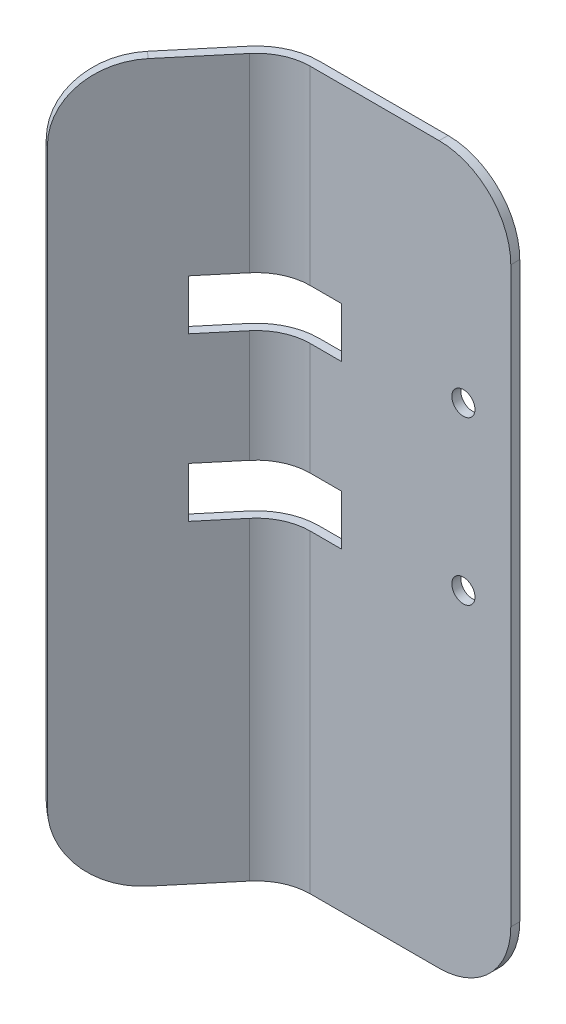
ISO-10303-21;
HEADER;
FILE_DESCRIPTION(('STEP AP214'),'2;1');
FILE_NAME('part.step','',(''),(''),'','','');
FILE_SCHEMA(('AUTOMOTIVE_DESIGN { 1 0 10303 214 1 1 1 1 }'));
ENDSEC;
DATA;
#1=APPLICATION_CONTEXT('core data for automotive mechanical design processes');
#2=APPLICATION_PROTOCOL_DEFINITION('international standard','automotive_design',2000,#1);
#3=PRODUCT_CONTEXT('',#1,'mechanical');
#4=PRODUCT('Part','Part','',(#3));
#5=PRODUCT_RELATED_PRODUCT_CATEGORY('part','',(#4));
#6=PRODUCT_DEFINITION_FORMATION('','',#4);
#7=PRODUCT_DEFINITION_CONTEXT('part definition',#1,'design');
#8=PRODUCT_DEFINITION('design','',#6,#7);
#9=PRODUCT_DEFINITION_SHAPE('','',#8);
#10=(LENGTH_UNIT() NAMED_UNIT(*) SI_UNIT(.MILLI.,.METRE.));
#11=(NAMED_UNIT(*) PLANE_ANGLE_UNIT() SI_UNIT($,.RADIAN.));
#12=(NAMED_UNIT(*) SI_UNIT($,.STERADIAN.) SOLID_ANGLE_UNIT());
#13=UNCERTAINTY_MEASURE_WITH_UNIT(LENGTH_MEASURE(1.E-05),#10,'distance_accuracy_value','');
#14=(GEOMETRIC_REPRESENTATION_CONTEXT(3) GLOBAL_UNCERTAINTY_ASSIGNED_CONTEXT((#13)) GLOBAL_UNIT_ASSIGNED_CONTEXT((#10,
#11,#12)) REPRESENTATION_CONTEXT('',''));
#15=CARTESIAN_POINT('',(0.,0.,0.));
#16=DIRECTION('',(0.,0.,1.));
#17=DIRECTION('',(1.,0.,0.));
#18=AXIS2_PLACEMENT_3D('',#15,#16,#17);
#19=CARTESIAN_POINT('',(-35.56,127.,9.52500000000001));
#20=DIRECTION('',(0.,-1.,0.));
#21=DIRECTION('',(0.,0.,-1.));
#22=AXIS2_PLACEMENT_3D('',#19,#20,#21);
#23=CYLINDRICAL_SURFACE('',#22,11.1125);
#24=DIRECTION('',(0.,-1.,0.));
#25=VECTOR('',#24,1.);
#26=CARTESIAN_POINT('',(-44.0726688741597,127.,2.38202268735836));
#27=LINE('',#26,#25);
#28=CARTESIAN_POINT('',(-44.0726688741597,84.455,2.38202268735836));
#29=VERTEX_POINT('',#28);
#30=CARTESIAN_POINT('',(-44.0726688741597,64.561067728,2.38202268735836));
#31=VERTEX_POINT('',#30);
#32=EDGE_CURVE('E387',#29,#31,#27,.T.);
#33=ORIENTED_EDGE('',*,*,#32,.F.);
#34=CARTESIAN_POINT('',(-35.56,84.455,9.52500000000001));
#35=DIRECTION('',(0.,-1.,0.));
#36=DIRECTION('',(0.,0.,-1.));
#37=AXIS2_PLACEMENT_3D('',#34,#35,#36);
#38=CIRCLE('',#37,11.1125);
#39=CARTESIAN_POINT('',(-35.56,84.455,-1.5875));
#40=VERTEX_POINT('',#39);
#41=EDGE_CURVE('E307',#29,#40,#38,.T.);
#42=ORIENTED_EDGE('',*,*,#41,.T.);
#43=DIRECTION('',(0.,-1.,0.));
#44=VECTOR('',#43,1.);
#45=CARTESIAN_POINT('',(-35.56,127.,-1.5875));
#46=LINE('',#45,#44);
#47=CARTESIAN_POINT('',(-35.56,64.561067728,-1.5875));
#48=VERTEX_POINT('',#47);
#49=EDGE_CURVE('E393',#40,#48,#46,.T.);
#50=ORIENTED_EDGE('',*,*,#49,.T.);
#51=CARTESIAN_POINT('',(-35.56,64.561067728,9.52500000000001));
#52=DIRECTION('',(0.,1.,0.));
#53=DIRECTION('',(-1.,0.,0.));
#54=AXIS2_PLACEMENT_3D('',#51,#52,#53);
#55=CIRCLE('',#54,11.1125);
#56=EDGE_CURVE('E256',#48,#31,#55,.T.);
#57=ORIENTED_EDGE('',*,*,#56,.T.);
#58=EDGE_LOOP('',(#33,#42,#50,#57));
#59=FACE_BOUND('',#58,.T.);
#60=ADVANCED_FACE('F37',(#59),#23,.T.);
#61=CARTESIAN_POINT('',(-44.0726688741597,55.671067728,2.38202268735836));
#62=VERTEX_POINT('',#61);
#63=CARTESIAN_POINT('',(-44.0726688741597,0.,2.38202268735836));
#64=VERTEX_POINT('',#63);
#65=EDGE_CURVE('E381',#62,#64,#27,.T.);
#66=ORIENTED_EDGE('',*,*,#65,.F.);
#67=CARTESIAN_POINT('',(-35.56,55.671067728,9.52500000000001));
#68=DIRECTION('',(0.,-1.,0.));
#69=DIRECTION('',(0.,0.,-1.));
#70=AXIS2_PLACEMENT_3D('',#67,#68,#69);
#71=CIRCLE('',#70,11.1125);
#72=CARTESIAN_POINT('',(-35.56,55.671067728,-1.5875));
#73=VERTEX_POINT('',#72);
#74=EDGE_CURVE('E276',#62,#73,#71,.T.);
#75=ORIENTED_EDGE('',*,*,#74,.T.);
#76=CARTESIAN_POINT('',(-35.56,0.,-1.5875));
#77=VERTEX_POINT('',#76);
#78=EDGE_CURVE('E386',#73,#77,#46,.T.);
#79=ORIENTED_EDGE('',*,*,#78,.T.);
#80=CARTESIAN_POINT('',(-35.56,0.,9.52500000000001));
#81=DIRECTION('',(0.,1.,0.));
#82=DIRECTION('',(0.,0.,1.));
#83=AXIS2_PLACEMENT_3D('',#80,#81,#82);
#84=CIRCLE('',#83,11.1125);
#85=EDGE_CURVE('E343',#77,#64,#84,.T.);
#86=ORIENTED_EDGE('',*,*,#85,.T.);
#87=EDGE_LOOP('',(#66,#75,#79,#86));
#88=FACE_BOUND('',#87,.T.);
#89=ADVANCED_FACE('F563',(#88),#23,.T.);
#90=CARTESIAN_POINT('',(-35.56,127.,9.52500000000001));
#91=DIRECTION('',(0.,-1.,0.));
#92=DIRECTION('',(0.,0.,-1.));
#93=AXIS2_PLACEMENT_3D('',#90,#91,#92);
#94=CYLINDRICAL_SURFACE('',#93,9.525);
#95=DIRECTION('',(0.,-1.,0.));
#96=VECTOR('',#95,1.);
#97=CARTESIAN_POINT('',(-35.56,127.,0.));
#98=LINE('',#97,#96);
#99=CARTESIAN_POINT('',(-35.56,84.455,0.));
#100=VERTEX_POINT('',#99);
#101=CARTESIAN_POINT('',(-35.56,64.561067728,0.));
#102=VERTEX_POINT('',#101);
#103=EDGE_CURVE('E367',#100,#102,#98,.T.);
#104=ORIENTED_EDGE('',*,*,#103,.F.);
#105=CARTESIAN_POINT('',(-35.56,84.455,9.52500000000001));
#106=DIRECTION('',(0.,-1.,0.));
#107=DIRECTION('',(0.,0.,-1.));
#108=AXIS2_PLACEMENT_3D('',#105,#106,#107);
#109=CIRCLE('',#108,9.525);
#110=CARTESIAN_POINT('',(-42.8565733207083,84.455,3.40244801773573));
#111=VERTEX_POINT('',#110);
#112=EDGE_CURVE('E295',#100,#111,#109,.F.);
#113=ORIENTED_EDGE('',*,*,#112,.T.);
#114=DIRECTION('',(0.,-1.,0.));
#115=VECTOR('',#114,1.);
#116=CARTESIAN_POINT('',(-42.8565733207083,127.,3.40244801773573));
#117=LINE('',#116,#115);
#118=CARTESIAN_POINT('',(-42.8565733207083,64.561067728,3.40244801773573));
#119=VERTEX_POINT('',#118);
#120=EDGE_CURVE('E373',#111,#119,#117,.T.);
#121=ORIENTED_EDGE('',*,*,#120,.T.);
#122=CARTESIAN_POINT('',(-35.56,64.561067728,9.52500000000001));
#123=DIRECTION('',(0.,1.,0.));
#124=DIRECTION('',(-1.,0.,0.));
#125=AXIS2_PLACEMENT_3D('',#122,#123,#124);
#126=CIRCLE('',#125,9.525);
#127=EDGE_CURVE('E248',#119,#102,#126,.F.);
#128=ORIENTED_EDGE('',*,*,#127,.T.);
#129=EDGE_LOOP('',(#104,#113,#121,#128));
#130=FACE_BOUND('',#129,.T.);
#131=ADVANCED_FACE('F575',(#130),#94,.F.);
#132=CARTESIAN_POINT('',(-35.56,55.671067728,0.));
#133=VERTEX_POINT('',#132);
#134=CARTESIAN_POINT('',(-35.56,0.,0.));
#135=VERTEX_POINT('',#134);
#136=EDGE_CURVE('E361',#133,#135,#98,.T.);
#137=ORIENTED_EDGE('',*,*,#136,.F.);
#138=CARTESIAN_POINT('',(-35.56,55.671067728,9.52500000000001));
#139=DIRECTION('',(0.,-1.,0.));
#140=DIRECTION('',(0.,0.,-1.));
#141=AXIS2_PLACEMENT_3D('',#138,#139,#140);
#142=CIRCLE('',#141,9.525);
#143=CARTESIAN_POINT('',(-42.8565733207083,55.671067728,3.40244801773573));
#144=VERTEX_POINT('',#143);
#145=EDGE_CURVE('E266',#133,#144,#142,.F.);
#146=ORIENTED_EDGE('',*,*,#145,.T.);
#147=CARTESIAN_POINT('',(-42.8565733207083,0.,3.40244801773573));
#148=VERTEX_POINT('',#147);
#149=EDGE_CURVE('E366',#144,#148,#117,.T.);
#150=ORIENTED_EDGE('',*,*,#149,.T.);
#151=CARTESIAN_POINT('',(-35.56,0.,9.52500000000001));
#152=DIRECTION('',(0.,-1.,0.));
#153=DIRECTION('',(0.,0.,1.));
#154=AXIS2_PLACEMENT_3D('',#151,#152,#153);
#155=CIRCLE('',#154,9.525);
#156=EDGE_CURVE('E353',#148,#135,#155,.T.);
#157=ORIENTED_EDGE('',*,*,#156,.T.);
#158=EDGE_LOOP('',(#137,#146,#150,#157));
#159=FACE_BOUND('',#158,.T.);
#160=ADVANCED_FACE('F583',(#159),#94,.F.);
#161=CARTESIAN_POINT('',(0.,127.,-1.5875));
#162=DIRECTION('',(-1.,0.,0.));
#163=DIRECTION('',(0.,0.,1.));
#164=AXIS2_PLACEMENT_3D('',#161,#162,#163);
#165=PLANE('',#164);
#166=DIRECTION('',(0.,-1.,0.));
#167=VECTOR('',#166,1.);
#168=CARTESIAN_POINT('',(0.,127.,-1.5875));
#169=LINE('',#168,#167);
#170=CARTESIAN_POINT('',(0.,114.3,-1.5875));
#171=VERTEX_POINT('',#170);
#172=CARTESIAN_POINT('',(0.,12.7,-1.5875));
#173=VERTEX_POINT('',#172);
#174=EDGE_CURVE('E392',#171,#173,#169,.T.);
#175=ORIENTED_EDGE('',*,*,#174,.F.);
#176=DIRECTION('',(0.,0.,-1.));
#177=VECTOR('',#176,1.);
#178=CARTESIAN_POINT('',(0.,114.3,0.));
#179=LINE('',#178,#177);
#180=CARTESIAN_POINT('',(0.,114.3,0.));
#181=VERTEX_POINT('',#180);
#182=EDGE_CURVE('E59',#171,#181,#179,.F.);
#183=ORIENTED_EDGE('',*,*,#182,.T.);
#184=DIRECTION('',(0.,-1.,0.));
#185=VECTOR('',#184,1.);
#186=CARTESIAN_POINT('',(0.,127.,0.));
#187=LINE('',#186,#185);
#188=CARTESIAN_POINT('',(0.,12.7,0.));
#189=VERTEX_POINT('',#188);
#190=EDGE_CURVE('E340',#181,#189,#187,.T.);
#191=ORIENTED_EDGE('',*,*,#190,.T.);
#192=DIRECTION('',(0.,0.,-1.));
#193=VECTOR('',#192,1.);
#194=CARTESIAN_POINT('',(0.,12.7,-1.5875));
#195=LINE('',#194,#193);
#196=EDGE_CURVE('E466',#189,#173,#195,.T.);
#197=ORIENTED_EDGE('',*,*,#196,.T.);
#198=EDGE_LOOP('',(#175,#183,#191,#197));
#199=FACE_BOUND('',#198,.T.);
#200=ADVANCED_FACE('F534',(#199),#165,.F.);
#201=CARTESIAN_POINT('',(0.,127.,-1.5875));
#202=DIRECTION('',(0.,0.,1.));
#203=DIRECTION('',(1.,0.,0.));
#204=AXIS2_PLACEMENT_3D('',#201,#202,#203);
#205=PLANE('',#204);
#206=CARTESIAN_POINT('',(-8.399999964,60.116067728,-1.5875));
#207=DIRECTION('',(0.,0.,-1.));
#208=DIRECTION('',(-1.,0.,0.));
#209=AXIS2_PLACEMENT_3D('',#206,#207,#208);
#210=CIRCLE('',#209,2.049999964);
#211=CARTESIAN_POINT('',(-10.449999928,60.116067728,-1.5875));
#212=VERTEX_POINT('',#211);
#213=EDGE_CURVE('E479',#212,#212,#210,.T.);
#214=ORIENTED_EDGE('',*,*,#213,.F.);
#215=EDGE_LOOP('',(#214));
#216=FACE_BOUND('',#215,.T.);
#217=CARTESIAN_POINT('',(-8.39999996399993,88.9,-1.5875));
#218=DIRECTION('',(0.,0.,-1.));
#219=DIRECTION('',(-1.,0.,0.));
#220=AXIS2_PLACEMENT_3D('',#217,#218,#219);
#221=CIRCLE('',#220,2.049999964);
#222=CARTESIAN_POINT('',(-10.4499999279999,88.9,-1.5875));
#223=VERTEX_POINT('',#222);
#224=EDGE_CURVE('E401',#223,#223,#221,.T.);
#225=ORIENTED_EDGE('',*,*,#224,.F.);
#226=EDGE_LOOP('',(#225));
#227=FACE_BOUND('',#226,.T.);
#228=DIRECTION('',(-1.,0.,0.));
#229=VECTOR('',#228,1.);
#230=CARTESIAN_POINT('',(0.,127.,-1.5875));
#231=LINE('',#230,#229);
#232=CARTESIAN_POINT('',(-12.7,127.,-1.5875));
#233=VERTEX_POINT('',#232);
#234=CARTESIAN_POINT('',(-35.56,127.,-1.5875));
#235=VERTEX_POINT('',#234);
#236=EDGE_CURVE('E319',#233,#235,#231,.T.);
#237=ORIENTED_EDGE('',*,*,#236,.F.);
#238=CARTESIAN_POINT('',(-12.7,114.3,-1.5875));
#239=DIRECTION('',(0.,0.,1.));
#240=DIRECTION('',(1.,0.,0.));
#241=AXIS2_PLACEMENT_3D('',#238,#239,#240);
#242=CIRCLE('',#241,12.7);
#243=EDGE_CURVE('E463',#233,#171,#242,.F.);
#244=ORIENTED_EDGE('',*,*,#243,.T.);
#245=ORIENTED_EDGE('',*,*,#174,.T.);
#246=CARTESIAN_POINT('',(-12.7,12.7,-1.5875));
#247=DIRECTION('',(0.,0.,1.));
#248=DIRECTION('',(1.,0.,0.));
#249=AXIS2_PLACEMENT_3D('',#246,#247,#248);
#250=CIRCLE('',#249,12.7);
#251=CARTESIAN_POINT('',(-12.7,0.,-1.5875));
#252=VERTEX_POINT('',#251);
#253=EDGE_CURVE('E460',#173,#252,#250,.F.);
#254=ORIENTED_EDGE('',*,*,#253,.T.);
#255=DIRECTION('',(-1.,0.,0.));
#256=VECTOR('',#255,1.);
#257=CARTESIAN_POINT('',(0.,0.,-1.5875));
#258=LINE('',#257,#256);
#259=EDGE_CURVE('E318',#252,#77,#258,.T.);
#260=ORIENTED_EDGE('',*,*,#259,.T.);
#261=ORIENTED_EDGE('',*,*,#78,.F.);
#262=DIRECTION('',(-1.,0.,0.));
#263=VECTOR('',#262,1.);
#264=CARTESIAN_POINT('',(-29.989999964,55.671067728,-1.5875));
#265=LINE('',#264,#263);
#266=CARTESIAN_POINT('',(-29.989999964,55.671067728,-1.5875));
#267=VERTEX_POINT('',#266);
#268=EDGE_CURVE('E499',#267,#73,#265,.T.);
#269=ORIENTED_EDGE('',*,*,#268,.F.);
#270=DIRECTION('',(0.,-1.,0.));
#271=VECTOR('',#270,1.);
#272=CARTESIAN_POINT('',(-29.989999964,55.671067728,-1.5875));
#273=LINE('',#272,#271);
#274=CARTESIAN_POINT('',(-29.989999964,64.561067728,-1.5875));
#275=VERTEX_POINT('',#274);
#276=EDGE_CURVE('E497',#275,#267,#273,.T.);
#277=ORIENTED_EDGE('',*,*,#276,.F.);
#278=DIRECTION('',(1.,0.,0.));
#279=VECTOR('',#278,1.);
#280=CARTESIAN_POINT('',(-29.989999964,64.561067728,-1.5875));
#281=LINE('',#280,#279);
#282=EDGE_CURVE('E486',#48,#275,#281,.T.);
#283=ORIENTED_EDGE('',*,*,#282,.F.);
#284=ORIENTED_EDGE('',*,*,#49,.F.);
#285=DIRECTION('',(-1.,0.,0.));
#286=VECTOR('',#285,1.);
#287=CARTESIAN_POINT('',(-29.9899999639999,84.455,-1.5875));
#288=LINE('',#287,#286);
#289=CARTESIAN_POINT('',(-29.9899999639999,84.455,-1.5875));
#290=VERTEX_POINT('',#289);
#291=EDGE_CURVE('E476',#290,#40,#288,.T.);
#292=ORIENTED_EDGE('',*,*,#291,.F.);
#293=DIRECTION('',(0.,-1.,0.));
#294=VECTOR('',#293,1.);
#295=CARTESIAN_POINT('',(-29.9899999639999,84.455,-1.5875));
#296=LINE('',#295,#294);
#297=CARTESIAN_POINT('',(-29.9899999639999,93.345,-1.5875));
#298=VERTEX_POINT('',#297);
#299=EDGE_CURVE('E490',#298,#290,#296,.T.);
#300=ORIENTED_EDGE('',*,*,#299,.F.);
#301=DIRECTION('',(1.,0.,0.));
#302=VECTOR('',#301,1.);
#303=CARTESIAN_POINT('',(-29.9899999639999,93.345,-1.5875));
#304=LINE('',#303,#302);
#305=CARTESIAN_POINT('',(-35.56,93.345,-1.5875));
#306=VERTEX_POINT('',#305);
#307=EDGE_CURVE('E492',#306,#298,#304,.T.);
#308=ORIENTED_EDGE('',*,*,#307,.F.);
#309=EDGE_CURVE('E388',#235,#306,#46,.T.);
#310=ORIENTED_EDGE('',*,*,#309,.F.);
#311=EDGE_LOOP('',(#237,#244,#245,#254,#260,#261,#269,#277,#283,#284,#292,#300,#308,#310));
#312=FACE_BOUND('',#311,.T.);
#313=ADVANCED_FACE('F530',(#216,#227,#312),#205,.F.);
#314=ORIENTED_EDGE('',*,*,#309,.T.);
#315=CARTESIAN_POINT('',(-35.56,93.345,9.52500000000001));
#316=DIRECTION('',(0.,1.,0.));
#317=DIRECTION('',(0.,0.,1.));
#318=AXIS2_PLACEMENT_3D('',#315,#316,#317);
#319=CIRCLE('',#318,11.1125);
#320=CARTESIAN_POINT('',(-44.0726688741597,93.345,2.38202268735836));
#321=VERTEX_POINT('',#320);
#322=EDGE_CURVE('E291',#306,#321,#319,.T.);
#323=ORIENTED_EDGE('',*,*,#322,.T.);
#324=CARTESIAN_POINT('',(-44.0726688741597,127.,2.38202268735836));
#325=VERTEX_POINT('',#324);
#326=EDGE_CURVE('E382',#325,#321,#27,.T.);
#327=ORIENTED_EDGE('',*,*,#326,.F.);
#328=CARTESIAN_POINT('',(-35.56,127.,9.52500000000001));
#329=DIRECTION('',(0.,1.,0.));
#330=DIRECTION('',(0.,0.,1.));
#331=AXIS2_PLACEMENT_3D('',#328,#329,#330);
#332=CIRCLE('',#331,11.1125);
#333=EDGE_CURVE('E322',#235,#325,#332,.T.);
#334=ORIENTED_EDGE('',*,*,#333,.F.);
#335=EDGE_LOOP('',(#314,#323,#327,#334));
#336=FACE_BOUND('',#335,.T.);
#337=ADVANCED_FACE('F533',(#336),#23,.T.);
#338=CARTESIAN_POINT('',(-44.0726688741597,127.,2.38202268735836));
#339=DIRECTION('',(0.76604444311898,0.,0.642787609686537));
#340=DIRECTION('',(0.642787609686537,0.,-0.76604444311898));
#341=AXIS2_PLACEMENT_3D('',#338,#339,#340);
#342=PLANE('',#341);
#343=DIRECTION('',(0.,-1.,0.));
#344=VECTOR('',#343,1.);
#345=CARTESIAN_POINT('',(-60.4330574842094,127.,21.8795745896226));
#346=LINE('',#345,#344);
#347=CARTESIAN_POINT('',(-60.4330574842094,114.3,21.8795745896226));
#348=VERTEX_POINT('',#347);
#349=CARTESIAN_POINT('',(-60.4330574842094,12.7,21.8795745896226));
#350=VERTEX_POINT('',#349);
#351=EDGE_CURVE('E377',#348,#350,#346,.T.);
#352=ORIENTED_EDGE('',*,*,#351,.F.);
#353=CARTESIAN_POINT('',(-52.2696548411904,114.3,12.1508101620116));
#354=DIRECTION('',(0.76604444311898,0.,0.642787609686537));
#355=DIRECTION('',(0.642787609686537,0.,-0.76604444311898));
#356=AXIS2_PLACEMENT_3D('',#353,#354,#355);
#357=CIRCLE('',#356,12.7);
#358=CARTESIAN_POINT('',(-52.2696548411904,127.,12.1508101620116));
#359=VERTEX_POINT('',#358);
#360=EDGE_CURVE('E451',#348,#359,#357,.F.);
#361=ORIENTED_EDGE('',*,*,#360,.T.);
#362=DIRECTION('',(-0.642787609686537,0.,0.76604444311898));
#363=VECTOR('',#362,1.);
#364=CARTESIAN_POINT('',(-44.0726688741597,127.,2.38202268735836));
#365=LINE('',#364,#363);
#366=EDGE_CURVE('E326',#325,#359,#365,.T.);
#367=ORIENTED_EDGE('',*,*,#366,.F.);
#368=ORIENTED_EDGE('',*,*,#326,.T.);
#369=DIRECTION('',(-0.642787609686537,0.,0.76604444311898));
#370=VECTOR('',#369,1.);
#371=CARTESIAN_POINT('',(-44.0726688741597,93.345,2.38202268735836));
#372=LINE('',#371,#370);
#373=CARTESIAN_POINT('',(-49.0399999639999,93.345,8.30185735928045));
#374=VERTEX_POINT('',#373);
#375=EDGE_CURVE('E287',#321,#374,#372,.T.);
#376=ORIENTED_EDGE('',*,*,#375,.T.);
#377=DIRECTION('',(0.,-1.,0.));
#378=VECTOR('',#377,1.);
#379=CARTESIAN_POINT('',(-49.0399999639999,127.,8.30185735928045));
#380=LINE('',#379,#378);
#381=CARTESIAN_POINT('',(-49.0399999639999,84.455,8.30185735928045));
#382=VERTEX_POINT('',#381);
#383=EDGE_CURVE('E314',#374,#382,#380,.T.);
#384=ORIENTED_EDGE('',*,*,#383,.T.);
#385=DIRECTION('',(0.642787609686537,0.,-0.76604444311898));
#386=VECTOR('',#385,1.);
#387=CARTESIAN_POINT('',(-44.0726688741597,84.455,2.38202268735836));
#388=LINE('',#387,#386);
#389=EDGE_CURVE('E303',#382,#29,#388,.T.);
#390=ORIENTED_EDGE('',*,*,#389,.T.);
#391=ORIENTED_EDGE('',*,*,#32,.T.);
#392=DIRECTION('',(-0.642787609686537,0.,0.76604444311898));
#393=VECTOR('',#392,1.);
#394=CARTESIAN_POINT('',(-44.0726688741597,64.561067728,2.38202268735838));
#395=LINE('',#394,#393);
#396=CARTESIAN_POINT('',(-49.039999964,64.561067728,8.30185735928054));
#397=VERTEX_POINT('',#396);
#398=EDGE_CURVE('E251',#31,#397,#395,.T.);
#399=ORIENTED_EDGE('',*,*,#398,.T.);
#400=DIRECTION('',(0.,-1.,0.));
#401=VECTOR('',#400,1.);
#402=CARTESIAN_POINT('',(-49.039999964,127.,8.30185735928055));
#403=LINE('',#402,#401);
#404=CARTESIAN_POINT('',(-49.0399999639999,55.671067728,8.30185735928061));
#405=VERTEX_POINT('',#404);
#406=EDGE_CURVE('E228',#397,#405,#403,.T.);
#407=ORIENTED_EDGE('',*,*,#406,.T.);
#408=DIRECTION('',(0.642787609686537,0.,-0.76604444311898));
#409=VECTOR('',#408,1.);
#410=CARTESIAN_POINT('',(-44.0726688741597,55.671067728,2.38202268735836));
#411=LINE('',#410,#409);
#412=EDGE_CURVE('E272',#405,#62,#411,.T.);
#413=ORIENTED_EDGE('',*,*,#412,.T.);
#414=ORIENTED_EDGE('',*,*,#65,.T.);
#415=DIRECTION('',(-0.642787609686537,0.,0.76604444311898));
#416=VECTOR('',#415,1.);
#417=CARTESIAN_POINT('',(-44.0726688741597,0.,2.38202268735836));
#418=LINE('',#417,#416);
#419=CARTESIAN_POINT('',(-52.2696548411904,0.,12.1508101620116));
#420=VERTEX_POINT('',#419);
#421=EDGE_CURVE('E347',#64,#420,#418,.T.);
#422=ORIENTED_EDGE('',*,*,#421,.T.);
#423=CARTESIAN_POINT('',(-52.2696548411904,12.7,12.1508101620116));
#424=DIRECTION('',(0.76604444311898,0.,0.642787609686537));
#425=DIRECTION('',(0.642787609686537,0.,-0.76604444311898));
#426=AXIS2_PLACEMENT_3D('',#423,#424,#425);
#427=CIRCLE('',#426,12.7);
#428=EDGE_CURVE('E448',#420,#350,#427,.F.);
#429=ORIENTED_EDGE('',*,*,#428,.T.);
#430=EDGE_LOOP('',(#352,#361,#367,#368,#376,#384,#390,#391,#399,#407,#413,#414,#422,#429));
#431=FACE_BOUND('',#430,.T.);
#432=ADVANCED_FACE('F591',(#431),#342,.F.);
#433=CARTESIAN_POINT('',(-60.4330574842094,127.,21.8795745896226));
#434=DIRECTION('',(0.642787609686537,0.,-0.76604444311898));
#435=DIRECTION('',(-0.76604444311898,0.,-0.642787609686537));
#436=AXIS2_PLACEMENT_3D('',#433,#434,#435);
#437=PLANE('',#436);
#438=DIRECTION('',(0.,-1.,0.));
#439=VECTOR('',#438,1.);
#440=CARTESIAN_POINT('',(-59.216961930758,127.,22.89999992));
#441=LINE('',#440,#439);
#442=CARTESIAN_POINT('',(-59.216961930758,114.3,22.89999992));
#443=VERTEX_POINT('',#442);
#444=CARTESIAN_POINT('',(-59.216961930758,12.7,22.89999992));
#445=VERTEX_POINT('',#444);
#446=EDGE_CURVE('E372',#443,#445,#441,.T.);
#447=ORIENTED_EDGE('',*,*,#446,.F.);
#448=DIRECTION('',(0.76604444311898,0.,0.642787609686537));
#449=VECTOR('',#448,1.);
#450=CARTESIAN_POINT('',(-60.4330574842094,114.3,21.8795745896226));
#451=LINE('',#450,#449);
#452=EDGE_CURVE('E445',#443,#348,#451,.F.);
#453=ORIENTED_EDGE('',*,*,#452,.T.);
#454=ORIENTED_EDGE('',*,*,#351,.T.);
#455=DIRECTION('',(0.76604444311898,0.,0.642787609686537));
#456=VECTOR('',#455,1.);
#457=CARTESIAN_POINT('',(-60.4330574842094,12.7,21.8795745896226));
#458=LINE('',#457,#456);
#459=EDGE_CURVE('E442',#350,#445,#458,.T.);
#460=ORIENTED_EDGE('',*,*,#459,.T.);
#461=EDGE_LOOP('',(#447,#453,#454,#460));
#462=FACE_BOUND('',#461,.T.);
#463=ADVANCED_FACE('F595',(#462),#437,.F.);
#464=CARTESIAN_POINT('',(-42.8565733207083,127.,3.40244801773574));
#465=DIRECTION('',(-0.76604444311898,0.,-0.642787609686537));
#466=DIRECTION('',(-0.642787609686537,0.,0.76604444311898));
#467=AXIS2_PLACEMENT_3D('',#464,#465,#466);
#468=PLANE('',#467);
#469=DIRECTION('',(-0.642787609686537,0.,0.76604444311898));
#470=VECTOR('',#469,1.);
#471=CARTESIAN_POINT('',(-42.8565733207083,55.671067728,3.40244801773574));
#472=LINE('',#471,#470);
#473=CARTESIAN_POINT('',(-47.8239044105486,55.671067728,9.32228268965792));
#474=VERTEX_POINT('',#473);
#475=EDGE_CURVE('E243',#144,#474,#472,.T.);
#476=ORIENTED_EDGE('',*,*,#475,.T.);
#477=DIRECTION('',(0.,1.,0.));
#478=VECTOR('',#477,1.);
#479=CARTESIAN_POINT('',(-47.8239044105486,64.561067728,9.32228268965792));
#480=LINE('',#479,#478);
#481=CARTESIAN_POINT('',(-47.8239044105486,64.561067728,9.32228268965792));
#482=VERTEX_POINT('',#481);
#483=EDGE_CURVE('E225',#474,#482,#480,.T.);
#484=ORIENTED_EDGE('',*,*,#483,.T.);
#485=DIRECTION('',(0.642787609686537,0.,-0.76604444311898));
#486=VECTOR('',#485,1.);
#487=CARTESIAN_POINT('',(-42.8565733207083,64.561067728,3.40244801773576));
#488=LINE('',#487,#486);
#489=EDGE_CURVE('E240',#482,#119,#488,.T.);
#490=ORIENTED_EDGE('',*,*,#489,.T.);
#491=ORIENTED_EDGE('',*,*,#120,.F.);
#492=DIRECTION('',(-0.642787609686537,0.,0.76604444311898));
#493=VECTOR('',#492,1.);
#494=CARTESIAN_POINT('',(-42.8565733207083,84.455,3.40244801773574));
#495=LINE('',#494,#493);
#496=CARTESIAN_POINT('',(-47.8239044105486,84.455,9.32228268965783));
#497=VERTEX_POINT('',#496);
#498=EDGE_CURVE('E299',#111,#497,#495,.T.);
#499=ORIENTED_EDGE('',*,*,#498,.T.);
#500=DIRECTION('',(0.,1.,0.));
#501=VECTOR('',#500,1.);
#502=CARTESIAN_POINT('',(-47.8239044105486,93.345,9.32228268965783));
#503=LINE('',#502,#501);
#504=CARTESIAN_POINT('',(-47.8239044105486,93.345,9.32228268965783));
#505=VERTEX_POINT('',#504);
#506=EDGE_CURVE('E233',#497,#505,#503,.T.);
#507=ORIENTED_EDGE('',*,*,#506,.T.);
#508=DIRECTION('',(0.642787609686537,0.,-0.76604444311898));
#509=VECTOR('',#508,1.);
#510=CARTESIAN_POINT('',(-42.8565733207083,93.345,3.40244801773574));
#511=LINE('',#510,#509);
#512=CARTESIAN_POINT('',(-42.8565733207083,93.345,3.40244801773573));
#513=VERTEX_POINT('',#512);
#514=EDGE_CURVE('E284',#505,#513,#511,.T.);
#515=ORIENTED_EDGE('',*,*,#514,.T.);
#516=CARTESIAN_POINT('',(-42.8565733207083,127.,3.40244801773573));
#517=VERTEX_POINT('',#516);
#518=EDGE_CURVE('E368',#517,#513,#117,.T.);
#519=ORIENTED_EDGE('',*,*,#518,.F.);
#520=DIRECTION('',(0.642787609686537,0.,-0.76604444311898));
#521=VECTOR('',#520,1.);
#522=CARTESIAN_POINT('',(-42.8565733207083,127.,3.40244801773574));
#523=LINE('',#522,#521);
#524=CARTESIAN_POINT('',(-51.053559287739,127.,13.171235492389));
#525=VERTEX_POINT('',#524);
#526=EDGE_CURVE('E330',#525,#517,#523,.T.);
#527=ORIENTED_EDGE('',*,*,#526,.F.);
#528=CARTESIAN_POINT('',(-51.053559287739,114.3,13.171235492389));
#529=DIRECTION('',(-0.76604444311898,0.,-0.642787609686537));
#530=DIRECTION('',(-0.642787609686537,0.,0.76604444311898));
#531=AXIS2_PLACEMENT_3D('',#528,#529,#530);
#532=CIRCLE('',#531,12.7);
#533=EDGE_CURVE('E439',#525,#443,#532,.F.);
#534=ORIENTED_EDGE('',*,*,#533,.T.);
#535=ORIENTED_EDGE('',*,*,#446,.T.);
#536=CARTESIAN_POINT('',(-51.053559287739,12.7,13.171235492389));
#537=DIRECTION('',(-0.76604444311898,0.,-0.642787609686537));
#538=DIRECTION('',(-0.642787609686537,0.,0.76604444311898));
#539=AXIS2_PLACEMENT_3D('',#536,#537,#538);
#540=CIRCLE('',#539,12.7);
#541=CARTESIAN_POINT('',(-51.053559287739,0.,13.171235492389));
#542=VERTEX_POINT('',#541);
#543=EDGE_CURVE('E436',#445,#542,#540,.F.);
#544=ORIENTED_EDGE('',*,*,#543,.T.);
#545=DIRECTION('',(0.642787609686537,0.,-0.76604444311898));
#546=VECTOR('',#545,1.);
#547=CARTESIAN_POINT('',(-42.8565733207083,0.,3.40244801773574));
#548=LINE('',#547,#546);
#549=EDGE_CURVE('E351',#542,#148,#548,.T.);
#550=ORIENTED_EDGE('',*,*,#549,.T.);
#551=ORIENTED_EDGE('',*,*,#149,.F.);
#552=EDGE_LOOP('',(#476,#484,#490,#491,#499,#507,#515,#519,#527,#534,#535,#544,#550,#551));
#553=FACE_BOUND('',#552,.T.);
#554=ADVANCED_FACE('F238',(#553),#468,.F.);
#555=ORIENTED_EDGE('',*,*,#518,.T.);
#556=CARTESIAN_POINT('',(-35.56,93.345,9.52500000000001));
#557=DIRECTION('',(0.,1.,0.));
#558=DIRECTION('',(0.,0.,1.));
#559=AXIS2_PLACEMENT_3D('',#556,#557,#558);
#560=CIRCLE('',#559,9.525);
#561=CARTESIAN_POINT('',(-35.56,93.345,0.));
#562=VERTEX_POINT('',#561);
#563=EDGE_CURVE('E280',#513,#562,#560,.F.);
#564=ORIENTED_EDGE('',*,*,#563,.T.);
#565=CARTESIAN_POINT('',(-35.56,127.,0.));
#566=VERTEX_POINT('',#565);
#567=EDGE_CURVE('E362',#566,#562,#98,.T.);
#568=ORIENTED_EDGE('',*,*,#567,.F.);
#569=CARTESIAN_POINT('',(-35.56,127.,9.52500000000001));
#570=DIRECTION('',(0.,-1.,0.));
#571=DIRECTION('',(0.,0.,1.));
#572=AXIS2_PLACEMENT_3D('',#569,#570,#571);
#573=CIRCLE('',#572,9.525);
#574=EDGE_CURVE('E333',#517,#566,#573,.T.);
#575=ORIENTED_EDGE('',*,*,#574,.F.);
#576=EDGE_LOOP('',(#555,#564,#568,#575));
#577=FACE_BOUND('',#576,.T.);
#578=ADVANCED_FACE('F609',(#577),#94,.F.);
#579=CARTESIAN_POINT('',(0.,127.,0.));
#580=DIRECTION('',(0.,0.,-1.));
#581=DIRECTION('',(-1.,0.,0.));
#582=AXIS2_PLACEMENT_3D('',#579,#580,#581);
#583=PLANE('',#582);
#584=CARTESIAN_POINT('',(-8.399999964,60.116067728,0.));
#585=DIRECTION('',(0.,0.,-1.));
#586=DIRECTION('',(-1.,0.,0.));
#587=AXIS2_PLACEMENT_3D('',#584,#585,#586);
#588=CIRCLE('',#587,2.049999964);
#589=CARTESIAN_POINT('',(-10.449999928,60.116067728,0.));
#590=VERTEX_POINT('',#589);
#591=EDGE_CURVE('E311',#590,#590,#588,.T.);
#592=ORIENTED_EDGE('',*,*,#591,.T.);
#593=EDGE_LOOP('',(#592));
#594=FACE_BOUND('',#593,.T.);
#595=CARTESIAN_POINT('',(-8.39999996399993,88.9,0.));
#596=DIRECTION('',(0.,0.,-1.));
#597=DIRECTION('',(-1.,0.,0.));
#598=AXIS2_PLACEMENT_3D('',#595,#596,#597);
#599=CIRCLE('',#598,2.049999964);
#600=CARTESIAN_POINT('',(-10.4499999279999,88.9,0.));
#601=VERTEX_POINT('',#600);
#602=EDGE_CURVE('E259',#601,#601,#599,.T.);
#603=ORIENTED_EDGE('',*,*,#602,.T.);
#604=EDGE_LOOP('',(#603));
#605=FACE_BOUND('',#604,.T.);
#606=ORIENTED_EDGE('',*,*,#190,.F.);
#607=CARTESIAN_POINT('',(-12.7,114.3,0.));
#608=DIRECTION('',(0.,0.,-1.));
#609=DIRECTION('',(-1.,0.,0.));
#610=AXIS2_PLACEMENT_3D('',#607,#608,#609);
#611=CIRCLE('',#610,12.7);
#612=CARTESIAN_POINT('',(-12.7,127.,0.));
#613=VERTEX_POINT('',#612);
#614=EDGE_CURVE('E11',#181,#613,#611,.F.);
#615=ORIENTED_EDGE('',*,*,#614,.T.);
#616=DIRECTION('',(1.,0.,0.));
#617=VECTOR('',#616,1.);
#618=CARTESIAN_POINT('',(0.,127.,0.));
#619=LINE('',#618,#617);
#620=EDGE_CURVE('E336',#566,#613,#619,.T.);
#621=ORIENTED_EDGE('',*,*,#620,.F.);
#622=ORIENTED_EDGE('',*,*,#567,.T.);
#623=DIRECTION('',(1.,0.,0.));
#624=VECTOR('',#623,1.);
#625=CARTESIAN_POINT('',(0.,93.345,0.));
#626=LINE('',#625,#624);
#627=CARTESIAN_POINT('',(-29.9899999639999,93.345,0.));
#628=VERTEX_POINT('',#627);
#629=EDGE_CURVE('E413',#562,#628,#626,.T.);
#630=ORIENTED_EDGE('',*,*,#629,.T.);
#631=DIRECTION('',(0.,-1.,0.));
#632=VECTOR('',#631,1.);
#633=CARTESIAN_POINT('',(-29.9899999639999,127.,0.));
#634=LINE('',#633,#632);
#635=CARTESIAN_POINT('',(-29.9899999639999,84.455,0.));
#636=VERTEX_POINT('',#635);
#637=EDGE_CURVE('E417',#628,#636,#634,.T.);
#638=ORIENTED_EDGE('',*,*,#637,.T.);
#639=DIRECTION('',(-1.,0.,0.));
#640=VECTOR('',#639,1.);
#641=CARTESIAN_POINT('',(0.,84.455,0.));
#642=LINE('',#641,#640);
#643=EDGE_CURVE('E421',#636,#100,#642,.T.);
#644=ORIENTED_EDGE('',*,*,#643,.T.);
#645=ORIENTED_EDGE('',*,*,#103,.T.);
#646=DIRECTION('',(1.,0.,0.));
#647=VECTOR('',#646,1.);
#648=CARTESIAN_POINT('',(0.,64.561067728,0.));
#649=LINE('',#648,#647);
#650=CARTESIAN_POINT('',(-29.989999964,64.561067728,0.));
#651=VERTEX_POINT('',#650);
#652=EDGE_CURVE('E397',#102,#651,#649,.T.);
#653=ORIENTED_EDGE('',*,*,#652,.T.);
#654=DIRECTION('',(0.,-1.,0.));
#655=VECTOR('',#654,1.);
#656=CARTESIAN_POINT('',(-29.989999964,127.,0.));
#657=LINE('',#656,#655);
#658=CARTESIAN_POINT('',(-29.989999964,55.671067728,0.));
#659=VERTEX_POINT('',#658);
#660=EDGE_CURVE('E405',#651,#659,#657,.T.);
#661=ORIENTED_EDGE('',*,*,#660,.T.);
#662=DIRECTION('',(-1.,0.,0.));
#663=VECTOR('',#662,1.);
#664=CARTESIAN_POINT('',(0.,55.671067728,0.));
#665=LINE('',#664,#663);
#666=EDGE_CURVE('E409',#659,#133,#665,.T.);
#667=ORIENTED_EDGE('',*,*,#666,.T.);
#668=ORIENTED_EDGE('',*,*,#136,.T.);
#669=DIRECTION('',(1.,0.,0.));
#670=VECTOR('',#669,1.);
#671=CARTESIAN_POINT('',(0.,0.,0.));
#672=LINE('',#671,#670);
#673=CARTESIAN_POINT('',(-12.7,0.,0.));
#674=VERTEX_POINT('',#673);
#675=EDGE_CURVE('E323',#135,#674,#672,.T.);
#676=ORIENTED_EDGE('',*,*,#675,.T.);
#677=CARTESIAN_POINT('',(-12.7,12.7,0.));
#678=DIRECTION('',(0.,0.,-1.));
#679=DIRECTION('',(-1.,0.,0.));
#680=AXIS2_PLACEMENT_3D('',#677,#678,#679);
#681=CIRCLE('',#680,12.7);
#682=EDGE_CURVE('E46',#674,#189,#681,.F.);
#683=ORIENTED_EDGE('',*,*,#682,.T.);
#684=EDGE_LOOP('',(#606,#615,#621,#622,#630,#638,#644,#645,#653,#661,#667,#668,#676,#683));
#685=FACE_BOUND('',#684,.T.);
#686=ADVANCED_FACE('F549',(#594,#605,#685),#583,.F.);
#687=CARTESIAN_POINT('',(-35.56,127.,9.52500000000001));
#688=DIRECTION('',(0.,1.,0.));
#689=DIRECTION('',(0.,0.,1.));
#690=AXIS2_PLACEMENT_3D('',#687,#688,#689);
#691=PLANE('',#690);
#692=ORIENTED_EDGE('',*,*,#366,.T.);
#693=DIRECTION('',(0.76604444311898,0.,0.642787609686537));
#694=VECTOR('',#693,1.);
#695=CARTESIAN_POINT('',(-51.053559287739,127.,13.171235492389));
#696=LINE('',#695,#694);
#697=EDGE_CURVE('E432',#359,#525,#696,.T.);
#698=ORIENTED_EDGE('',*,*,#697,.T.);
#699=ORIENTED_EDGE('',*,*,#526,.T.);
#700=ORIENTED_EDGE('',*,*,#574,.T.);
#701=ORIENTED_EDGE('',*,*,#620,.T.);
#702=DIRECTION('',(0.,0.,-1.));
#703=VECTOR('',#702,1.);
#704=CARTESIAN_POINT('',(-12.7,127.,-1.5875));
#705=LINE('',#704,#703);
#706=EDGE_CURVE('E425',#613,#233,#705,.T.);
#707=ORIENTED_EDGE('',*,*,#706,.T.);
#708=ORIENTED_EDGE('',*,*,#236,.T.);
#709=ORIENTED_EDGE('',*,*,#333,.T.);
#710=EDGE_LOOP('',(#692,#698,#699,#700,#701,#707,#708,#709));
#711=FACE_BOUND('',#710,.T.);
#712=ADVANCED_FACE('F542',(#711),#691,.T.);
#713=CARTESIAN_POINT('',(-35.56,0.,9.52500000000001));
#714=DIRECTION('',(0.,1.,0.));
#715=DIRECTION('',(0.,0.,1.));
#716=AXIS2_PLACEMENT_3D('',#713,#714,#715);
#717=PLANE('',#716);
#718=ORIENTED_EDGE('',*,*,#549,.F.);
#719=DIRECTION('',(0.76604444311898,0.,0.642787609686537));
#720=VECTOR('',#719,1.);
#721=CARTESIAN_POINT('',(-43.7569859670307,0.,19.2937874746532));
#722=LINE('',#721,#720);
#723=EDGE_CURVE('E457',#542,#420,#722,.F.);
#724=ORIENTED_EDGE('',*,*,#723,.T.);
#725=ORIENTED_EDGE('',*,*,#421,.F.);
#726=ORIENTED_EDGE('',*,*,#85,.F.);
#727=ORIENTED_EDGE('',*,*,#259,.F.);
#728=DIRECTION('',(0.,0.,-1.));
#729=VECTOR('',#728,1.);
#730=CARTESIAN_POINT('',(-12.7,0.,9.52500000000001));
#731=LINE('',#730,#729);
#732=EDGE_CURVE('E454',#252,#674,#731,.F.);
#733=ORIENTED_EDGE('',*,*,#732,.T.);
#734=ORIENTED_EDGE('',*,*,#675,.F.);
#735=ORIENTED_EDGE('',*,*,#156,.F.);
#736=EDGE_LOOP('',(#718,#724,#725,#726,#727,#733,#734,#735));
#737=FACE_BOUND('',#736,.T.);
#738=ADVANCED_FACE('F558',(#737),#717,.F.);
#739=CARTESIAN_POINT('',(-8.39999996399993,88.9,22.89999992));
#740=DIRECTION('',(0.,0.,-1.));
#741=DIRECTION('',(-1.,0.,0.));
#742=AXIS2_PLACEMENT_3D('',#739,#740,#741);
#743=CYLINDRICAL_SURFACE('',#742,2.049999964);
#744=ORIENTED_EDGE('',*,*,#224,.T.);
#745=EDGE_LOOP('',(#744));
#746=FACE_BOUND('',#745,.T.);
#747=ORIENTED_EDGE('',*,*,#602,.F.);
#748=EDGE_LOOP('',(#747));
#749=FACE_BOUND('',#748,.T.);
#750=ADVANCED_FACE('F527',(#746,#749),#743,.F.);
#751=CARTESIAN_POINT('',(-29.989999964,55.671067728,22.89999992));
#752=DIRECTION('',(0.,-1.,0.));
#753=DIRECTION('',(0.,0.,-1.));
#754=AXIS2_PLACEMENT_3D('',#751,#752,#753);
#755=PLANE('',#754);
#756=ORIENTED_EDGE('',*,*,#412,.F.);
#757=DIRECTION('',(0.76604444311898,0.,0.642787609686537));
#758=VECTOR('',#757,1.);
#759=CARTESIAN_POINT('',(-56.4578139268794,55.671067728,2.07757239888679));
#760=LINE('',#759,#758);
#761=EDGE_CURVE('E234',#405,#474,#760,.T.);
#762=ORIENTED_EDGE('',*,*,#761,.T.);
#763=ORIENTED_EDGE('',*,*,#475,.F.);
#764=ORIENTED_EDGE('',*,*,#145,.F.);
#765=ORIENTED_EDGE('',*,*,#666,.F.);
#766=DIRECTION('',(0.,0.,-1.));
#767=VECTOR('',#766,1.);
#768=CARTESIAN_POINT('',(-29.989999964,55.671067728,22.89999992));
#769=LINE('',#768,#767);
#770=EDGE_CURVE('E511',#659,#267,#769,.T.);
#771=ORIENTED_EDGE('',*,*,#770,.T.);
#772=ORIENTED_EDGE('',*,*,#268,.T.);
#773=ORIENTED_EDGE('',*,*,#74,.F.);
#774=EDGE_LOOP('',(#756,#762,#763,#764,#765,#771,#772,#773));
#775=FACE_BOUND('',#774,.T.);
#776=ADVANCED_FACE('F567',(#775),#755,.F.);
#777=CARTESIAN_POINT('',(-29.989999964,55.671067728,22.89999992));
#778=DIRECTION('',(1.,0.,0.));
#779=DIRECTION('',(0.,0.,-1.));
#780=AXIS2_PLACEMENT_3D('',#777,#778,#779);
#781=PLANE('',#780);
#782=DIRECTION('',(0.,0.,-1.));
#783=VECTOR('',#782,1.);
#784=CARTESIAN_POINT('',(-29.989999964,64.561067728,22.89999992));
#785=LINE('',#784,#783);
#786=EDGE_CURVE('E510',#651,#275,#785,.T.);
#787=ORIENTED_EDGE('',*,*,#786,.T.);
#788=ORIENTED_EDGE('',*,*,#276,.T.);
#789=ORIENTED_EDGE('',*,*,#770,.F.);
#790=ORIENTED_EDGE('',*,*,#660,.F.);
#791=EDGE_LOOP('',(#787,#788,#789,#790));
#792=FACE_BOUND('',#791,.T.);
#793=ADVANCED_FACE('F571',(#792),#781,.F.);
#794=CARTESIAN_POINT('',(-29.989999964,64.561067728,22.89999992));
#795=DIRECTION('',(0.,1.,0.));
#796=DIRECTION('',(-1.,0.,0.));
#797=AXIS2_PLACEMENT_3D('',#794,#795,#796);
#798=PLANE('',#797);
#799=ORIENTED_EDGE('',*,*,#489,.F.);
#800=DIRECTION('',(0.76604444311898,0.,0.642787609686537));
#801=VECTOR('',#800,1.);
#802=CARTESIAN_POINT('',(-56.4578139268794,64.561067728,2.07757239888679));
#803=LINE('',#802,#801);
#804=EDGE_CURVE('E222',#397,#482,#803,.T.);
#805=ORIENTED_EDGE('',*,*,#804,.F.);
#806=ORIENTED_EDGE('',*,*,#398,.F.);
#807=ORIENTED_EDGE('',*,*,#56,.F.);
#808=ORIENTED_EDGE('',*,*,#282,.T.);
#809=ORIENTED_EDGE('',*,*,#786,.F.);
#810=ORIENTED_EDGE('',*,*,#652,.F.);
#811=ORIENTED_EDGE('',*,*,#127,.F.);
#812=EDGE_LOOP('',(#799,#805,#806,#807,#808,#809,#810,#811));
#813=FACE_BOUND('',#812,.T.);
#814=ADVANCED_FACE('F246',(#813),#798,.F.);
#815=CARTESIAN_POINT('',(-29.9899999639999,84.455,22.89999992));
#816=DIRECTION('',(0.,-1.,0.));
#817=DIRECTION('',(0.,0.,-1.));
#818=AXIS2_PLACEMENT_3D('',#815,#816,#817);
#819=PLANE('',#818);
#820=ORIENTED_EDGE('',*,*,#389,.F.);
#821=DIRECTION('',(0.76604444311898,0.,0.642787609686537));
#822=VECTOR('',#821,1.);
#823=CARTESIAN_POINT('',(-56.4578139268793,84.455,2.0775723988867));
#824=LINE('',#823,#822);
#825=EDGE_CURVE('E487',#382,#497,#824,.T.);
#826=ORIENTED_EDGE('',*,*,#825,.T.);
#827=ORIENTED_EDGE('',*,*,#498,.F.);
#828=ORIENTED_EDGE('',*,*,#112,.F.);
#829=ORIENTED_EDGE('',*,*,#643,.F.);
#830=DIRECTION('',(0.,0.,-1.));
#831=VECTOR('',#830,1.);
#832=CARTESIAN_POINT('',(-29.9899999639999,84.455,22.89999992));
#833=LINE('',#832,#831);
#834=EDGE_CURVE('E475',#636,#290,#833,.T.);
#835=ORIENTED_EDGE('',*,*,#834,.T.);
#836=ORIENTED_EDGE('',*,*,#291,.T.);
#837=ORIENTED_EDGE('',*,*,#41,.F.);
#838=EDGE_LOOP('',(#820,#826,#827,#828,#829,#835,#836,#837));
#839=FACE_BOUND('',#838,.T.);
#840=ADVANCED_FACE('F620',(#839),#819,.F.);
#841=CARTESIAN_POINT('',(-29.9899999639999,84.455,22.89999992));
#842=DIRECTION('',(1.,0.,0.));
#843=DIRECTION('',(0.,0.,-1.));
#844=AXIS2_PLACEMENT_3D('',#841,#842,#843);
#845=PLANE('',#844);
#846=DIRECTION('',(0.,0.,-1.));
#847=VECTOR('',#846,1.);
#848=CARTESIAN_POINT('',(-29.9899999639999,93.345,22.89999992));
#849=LINE('',#848,#847);
#850=EDGE_CURVE('E474',#628,#298,#849,.T.);
#851=ORIENTED_EDGE('',*,*,#850,.T.);
#852=ORIENTED_EDGE('',*,*,#299,.T.);
#853=ORIENTED_EDGE('',*,*,#834,.F.);
#854=ORIENTED_EDGE('',*,*,#637,.F.);
#855=EDGE_LOOP('',(#851,#852,#853,#854));
#856=FACE_BOUND('',#855,.T.);
#857=ADVANCED_FACE('F616',(#856),#845,.F.);
#858=CARTESIAN_POINT('',(-29.9899999639999,93.345,22.89999992));
#859=DIRECTION('',(0.,1.,0.));
#860=DIRECTION('',(0.,0.,1.));
#861=AXIS2_PLACEMENT_3D('',#858,#859,#860);
#862=PLANE('',#861);
#863=ORIENTED_EDGE('',*,*,#514,.F.);
#864=DIRECTION('',(0.76604444311898,0.,0.642787609686537));
#865=VECTOR('',#864,1.);
#866=CARTESIAN_POINT('',(-56.4578139268793,93.345,2.0775723988867));
#867=LINE('',#866,#865);
#868=EDGE_CURVE('E485',#374,#505,#867,.T.);
#869=ORIENTED_EDGE('',*,*,#868,.F.);
#870=ORIENTED_EDGE('',*,*,#375,.F.);
#871=ORIENTED_EDGE('',*,*,#322,.F.);
#872=ORIENTED_EDGE('',*,*,#307,.T.);
#873=ORIENTED_EDGE('',*,*,#850,.F.);
#874=ORIENTED_EDGE('',*,*,#629,.F.);
#875=ORIENTED_EDGE('',*,*,#563,.F.);
#876=EDGE_LOOP('',(#863,#869,#870,#871,#872,#873,#874,#875));
#877=FACE_BOUND('',#876,.T.);
#878=ADVANCED_FACE('F612',(#877),#862,.F.);
#879=CARTESIAN_POINT('',(-8.399999964,60.116067728,22.89999992));
#880=DIRECTION('',(0.,0.,-1.));
#881=DIRECTION('',(-1.,0.,0.));
#882=AXIS2_PLACEMENT_3D('',#879,#880,#881);
#883=CYLINDRICAL_SURFACE('',#882,2.049999964);
#884=ORIENTED_EDGE('',*,*,#213,.T.);
#885=EDGE_LOOP('',(#884));
#886=FACE_BOUND('',#885,.T.);
#887=ORIENTED_EDGE('',*,*,#591,.F.);
#888=EDGE_LOOP('',(#887));
#889=FACE_BOUND('',#888,.T.);
#890=ADVANCED_FACE('F674',(#886,#889),#883,.F.);
#891=CARTESIAN_POINT('',(-43.7569859670307,114.3,19.2937874746532));
#892=DIRECTION('',(-0.76604444311898,0.,-0.642787609686537));
#893=DIRECTION('',(-0.642787609686537,0.,0.76604444311898));
#894=AXIS2_PLACEMENT_3D('',#891,#892,#893);
#895=CYLINDRICAL_SURFACE('',#894,12.7);
#896=ORIENTED_EDGE('',*,*,#360,.F.);
#897=ORIENTED_EDGE('',*,*,#452,.F.);
#898=ORIENTED_EDGE('',*,*,#533,.F.);
#899=ORIENTED_EDGE('',*,*,#697,.F.);
#900=EDGE_LOOP('',(#896,#897,#898,#899));
#901=FACE_BOUND('',#900,.T.);
#902=ADVANCED_FACE('F598',(#901),#895,.T.);
#903=CARTESIAN_POINT('',(-52.2696548411904,12.7,12.1508101620116));
#904=DIRECTION('',(0.76604444311898,0.,0.642787609686537));
#905=DIRECTION('',(0.642787609686537,0.,-0.76604444311898));
#906=AXIS2_PLACEMENT_3D('',#903,#904,#905);
#907=CYLINDRICAL_SURFACE('',#906,12.7);
#908=ORIENTED_EDGE('',*,*,#428,.F.);
#909=ORIENTED_EDGE('',*,*,#723,.F.);
#910=ORIENTED_EDGE('',*,*,#543,.F.);
#911=ORIENTED_EDGE('',*,*,#459,.F.);
#912=EDGE_LOOP('',(#908,#909,#910,#911));
#913=FACE_BOUND('',#912,.T.);
#914=ADVANCED_FACE('F587',(#913),#907,.T.);
#915=CARTESIAN_POINT('',(-12.7,114.3,9.52500000000001));
#916=DIRECTION('',(0.,0.,1.));
#917=DIRECTION('',(1.,0.,0.));
#918=AXIS2_PLACEMENT_3D('',#915,#916,#917);
#919=CYLINDRICAL_SURFACE('',#918,12.7);
#920=ORIENTED_EDGE('',*,*,#614,.F.);
#921=ORIENTED_EDGE('',*,*,#182,.F.);
#922=ORIENTED_EDGE('',*,*,#243,.F.);
#923=ORIENTED_EDGE('',*,*,#706,.F.);
#924=EDGE_LOOP('',(#920,#921,#922,#923));
#925=FACE_BOUND('',#924,.T.);
#926=ADVANCED_FACE('F548',(#925),#919,.T.);
#927=CARTESIAN_POINT('',(-12.7,12.7,-1.5875));
#928=DIRECTION('',(0.,0.,-1.));
#929=DIRECTION('',(-1.,0.,0.));
#930=AXIS2_PLACEMENT_3D('',#927,#928,#929);
#931=CYLINDRICAL_SURFACE('',#930,12.7);
#932=ORIENTED_EDGE('',*,*,#682,.F.);
#933=ORIENTED_EDGE('',*,*,#732,.F.);
#934=ORIENTED_EDGE('',*,*,#253,.F.);
#935=ORIENTED_EDGE('',*,*,#196,.F.);
#936=EDGE_LOOP('',(#932,#933,#934,#935));
#937=FACE_BOUND('',#936,.T.);
#938=ADVANCED_FACE('F39',(#937),#931,.T.);
#939=CARTESIAN_POINT('',(-56.4578139268793,93.345,2.0775723988867));
#940=DIRECTION('',(0.642787609686537,0.,-0.76604444311898));
#941=DIRECTION('',(-0.76604444311898,0.,-0.642787609686537));
#942=AXIS2_PLACEMENT_3D('',#939,#940,#941);
#943=PLANE('',#942);
#944=ORIENTED_EDGE('',*,*,#825,.F.);
#945=ORIENTED_EDGE('',*,*,#383,.F.);
#946=ORIENTED_EDGE('',*,*,#868,.T.);
#947=ORIENTED_EDGE('',*,*,#506,.F.);
#948=EDGE_LOOP('',(#944,#945,#946,#947));
#949=FACE_BOUND('',#948,.T.);
#950=ADVANCED_FACE('F633',(#949),#943,.T.);
#951=CARTESIAN_POINT('',(-56.4578139268794,64.561067728,2.07757239888679));
#952=DIRECTION('',(0.642787609686537,0.,-0.76604444311898));
#953=DIRECTION('',(-0.76604444311898,0.,-0.642787609686537));
#954=AXIS2_PLACEMENT_3D('',#951,#952,#953);
#955=PLANE('',#954);
#956=ORIENTED_EDGE('',*,*,#761,.F.);
#957=ORIENTED_EDGE('',*,*,#406,.F.);
#958=ORIENTED_EDGE('',*,*,#804,.T.);
#959=ORIENTED_EDGE('',*,*,#483,.F.);
#960=EDGE_LOOP('',(#956,#957,#958,#959));
#961=FACE_BOUND('',#960,.T.);
#962=ADVANCED_FACE('F224',(#961),#955,.T.);
#963=CLOSED_SHELL('',(#60,#89,#131,#160,#200,#313,#337,#432,#463,#554,#578,#686,#712,#738,#750,
#776,#793,#814,#840,#857,#878,#890,#902,#914,#926,#938,#950,#962));
#964=MANIFOLD_SOLID_BREP('B2',#963);
#965=ADVANCED_BREP_SHAPE_REPRESENTATION('',(#18,#964),#14);
#966=SHAPE_DEFINITION_REPRESENTATION(#9,#965);
ENDSEC;
END-ISO-10303-21;
